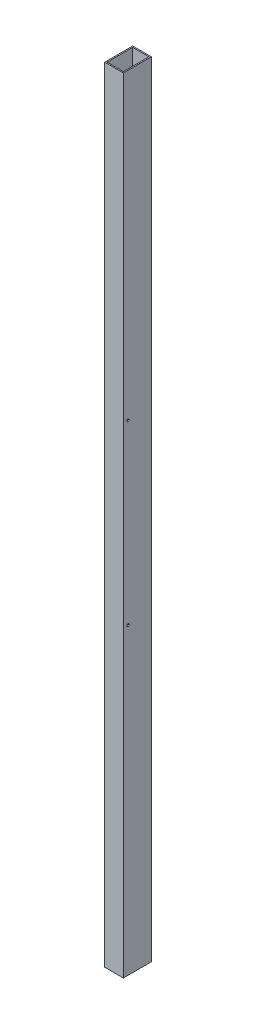
ISO-10303-21;
HEADER;
FILE_DESCRIPTION(('STEP AP214'),'2;1');
FILE_NAME('part.step','',(''),(''),'','','');
FILE_SCHEMA(('AUTOMOTIVE_DESIGN { 1 0 10303 214 1 1 1 1 }'));
ENDSEC;
DATA;
#1=APPLICATION_CONTEXT('core data for automotive mechanical design processes');
#2=APPLICATION_PROTOCOL_DEFINITION('international standard','automotive_design',2000,#1);
#3=PRODUCT_CONTEXT('',#1,'mechanical');
#4=PRODUCT('Part','Part','',(#3));
#5=PRODUCT_RELATED_PRODUCT_CATEGORY('part','',(#4));
#6=PRODUCT_DEFINITION_FORMATION('','',#4);
#7=PRODUCT_DEFINITION_CONTEXT('part definition',#1,'design');
#8=PRODUCT_DEFINITION('design','',#6,#7);
#9=PRODUCT_DEFINITION_SHAPE('','',#8);
#10=(LENGTH_UNIT() NAMED_UNIT(*) SI_UNIT(.MILLI.,.METRE.));
#11=(NAMED_UNIT(*) PLANE_ANGLE_UNIT() SI_UNIT($,.RADIAN.));
#12=(NAMED_UNIT(*) SI_UNIT($,.STERADIAN.) SOLID_ANGLE_UNIT());
#13=UNCERTAINTY_MEASURE_WITH_UNIT(LENGTH_MEASURE(1.E-05),#10,'distance_accuracy_value','');
#14=(GEOMETRIC_REPRESENTATION_CONTEXT(3) GLOBAL_UNCERTAINTY_ASSIGNED_CONTEXT((#13)) GLOBAL_UNIT_ASSIGNED_CONTEXT((#10,
#11,#12)) REPRESENTATION_CONTEXT('',''));
#15=CARTESIAN_POINT('',(0.,0.,0.));
#16=DIRECTION('',(0.,0.,1.));
#17=DIRECTION('',(1.,0.,0.));
#18=AXIS2_PLACEMENT_3D('',#15,#16,#17);
#19=CARTESIAN_POINT('',(0.,-1066.8,0.));
#20=DIRECTION('',(0.,-1.,0.));
#21=DIRECTION('',(1.,0.,0.));
#22=AXIS2_PLACEMENT_3D('',#19,#20,#21);
#23=PLANE('',#22);
#24=DIRECTION('',(0.,0.,-1.));
#25=VECTOR('',#24,1.);
#26=CARTESIAN_POINT('',(25.4,-1066.8,0.));
#27=LINE('',#26,#25);
#28=CARTESIAN_POINT('',(25.4,-1066.8,38.1));
#29=VERTEX_POINT('',#28);
#30=CARTESIAN_POINT('',(25.4,-1066.8,-38.1));
#31=VERTEX_POINT('',#30);
#32=EDGE_CURVE('E151',#29,#31,#27,.T.);
#33=ORIENTED_EDGE('',*,*,#32,.F.);
#34=DIRECTION('',(-1.,0.,0.));
#35=VECTOR('',#34,1.);
#36=CARTESIAN_POINT('',(0.,-1066.8,38.1));
#37=LINE('',#36,#35);
#38=CARTESIAN_POINT('',(-25.4,-1066.8,38.1));
#39=VERTEX_POINT('',#38);
#40=EDGE_CURVE('E155',#29,#39,#37,.T.);
#41=ORIENTED_EDGE('',*,*,#40,.T.);
#42=DIRECTION('',(0.,0.,-1.));
#43=VECTOR('',#42,1.);
#44=CARTESIAN_POINT('',(-25.4,-1066.8,0.));
#45=LINE('',#44,#43);
#46=CARTESIAN_POINT('',(-25.4,-1066.8,-38.1));
#47=VERTEX_POINT('',#46);
#48=EDGE_CURVE('E159',#39,#47,#45,.T.);
#49=ORIENTED_EDGE('',*,*,#48,.T.);
#50=DIRECTION('',(-1.,0.,0.));
#51=VECTOR('',#50,1.);
#52=CARTESIAN_POINT('',(0.,-1066.8,-38.1));
#53=LINE('',#52,#51);
#54=EDGE_CURVE('E162',#31,#47,#53,.T.);
#55=ORIENTED_EDGE('',*,*,#54,.F.);
#56=EDGE_LOOP('',(#33,#41,#49,#55));
#57=FACE_BOUND('',#56,.T.);
#58=DIRECTION('',(-1.,0.,0.));
#59=VECTOR('',#58,1.);
#60=CARTESIAN_POINT('',(0.,-1066.8,34.925));
#61=LINE('',#60,#59);
#62=CARTESIAN_POINT('',(22.225,-1066.8,34.925));
#63=VERTEX_POINT('',#62);
#64=CARTESIAN_POINT('',(-22.225,-1066.8,34.925));
#65=VERTEX_POINT('',#64);
#66=EDGE_CURVE('E136',#63,#65,#61,.T.);
#67=ORIENTED_EDGE('',*,*,#66,.F.);
#68=DIRECTION('',(0.,0.,-1.));
#69=VECTOR('',#68,1.);
#70=CARTESIAN_POINT('',(22.225,-1066.8,0.));
#71=LINE('',#70,#69);
#72=CARTESIAN_POINT('',(22.225,-1066.8,-34.925));
#73=VERTEX_POINT('',#72);
#74=EDGE_CURVE('E130',#63,#73,#71,.T.);
#75=ORIENTED_EDGE('',*,*,#74,.T.);
#76=DIRECTION('',(-1.,0.,0.));
#77=VECTOR('',#76,1.);
#78=CARTESIAN_POINT('',(0.,-1066.8,-34.925));
#79=LINE('',#78,#77);
#80=CARTESIAN_POINT('',(-22.225,-1066.8,-34.925));
#81=VERTEX_POINT('',#80);
#82=EDGE_CURVE('E111',#73,#81,#79,.T.);
#83=ORIENTED_EDGE('',*,*,#82,.T.);
#84=DIRECTION('',(0.,0.,-1.));
#85=VECTOR('',#84,1.);
#86=CARTESIAN_POINT('',(-22.225,-1066.8,0.));
#87=LINE('',#86,#85);
#88=EDGE_CURVE('E146',#65,#81,#87,.T.);
#89=ORIENTED_EDGE('',*,*,#88,.F.);
#90=EDGE_LOOP('',(#67,#75,#83,#89));
#91=FACE_BOUND('',#90,.T.);
#92=ADVANCED_FACE('F16',(#57,#91),#23,.T.);
#93=CARTESIAN_POINT('',(0.,1066.8,0.));
#94=DIRECTION('',(0.,-1.,0.));
#95=DIRECTION('',(1.,0.,0.));
#96=AXIS2_PLACEMENT_3D('',#93,#94,#95);
#97=PLANE('',#96);
#98=DIRECTION('',(0.,0.,-1.));
#99=VECTOR('',#98,1.);
#100=CARTESIAN_POINT('',(25.4,1066.8,0.));
#101=LINE('',#100,#99);
#102=CARTESIAN_POINT('',(25.4,1066.8,38.1));
#103=VERTEX_POINT('',#102);
#104=CARTESIAN_POINT('',(25.4,1066.8,-38.1));
#105=VERTEX_POINT('',#104);
#106=EDGE_CURVE('E167',#103,#105,#101,.T.);
#107=ORIENTED_EDGE('',*,*,#106,.T.);
#108=DIRECTION('',(-1.,0.,0.));
#109=VECTOR('',#108,1.);
#110=CARTESIAN_POINT('',(0.,1066.8,-38.1));
#111=LINE('',#110,#109);
#112=CARTESIAN_POINT('',(-25.4,1066.8,-38.1));
#113=VERTEX_POINT('',#112);
#114=EDGE_CURVE('E156',#105,#113,#111,.T.);
#115=ORIENTED_EDGE('',*,*,#114,.T.);
#116=DIRECTION('',(0.,0.,-1.));
#117=VECTOR('',#116,1.);
#118=CARTESIAN_POINT('',(-25.4,1066.8,0.));
#119=LINE('',#118,#117);
#120=CARTESIAN_POINT('',(-25.4,1066.8,38.1));
#121=VERTEX_POINT('',#120);
#122=EDGE_CURVE('E173',#121,#113,#119,.T.);
#123=ORIENTED_EDGE('',*,*,#122,.F.);
#124=DIRECTION('',(-1.,0.,0.));
#125=VECTOR('',#124,1.);
#126=CARTESIAN_POINT('',(0.,1066.8,38.1));
#127=LINE('',#126,#125);
#128=EDGE_CURVE('E170',#103,#121,#127,.T.);
#129=ORIENTED_EDGE('',*,*,#128,.F.);
#130=EDGE_LOOP('',(#107,#115,#123,#129));
#131=FACE_BOUND('',#130,.T.);
#132=DIRECTION('',(0.,0.,-1.));
#133=VECTOR('',#132,1.);
#134=CARTESIAN_POINT('',(22.225,1066.8,0.));
#135=LINE('',#134,#133);
#136=CARTESIAN_POINT('',(22.225,1066.8,34.925));
#137=VERTEX_POINT('',#136);
#138=CARTESIAN_POINT('',(22.225,1066.8,-34.925));
#139=VERTEX_POINT('',#138);
#140=EDGE_CURVE('E118',#137,#139,#135,.T.);
#141=ORIENTED_EDGE('',*,*,#140,.F.);
#142=DIRECTION('',(-1.,0.,0.));
#143=VECTOR('',#142,1.);
#144=CARTESIAN_POINT('',(0.,1066.8,34.925));
#145=LINE('',#144,#143);
#146=CARTESIAN_POINT('',(-22.225,1066.8,34.925));
#147=VERTEX_POINT('',#146);
#148=EDGE_CURVE('E125',#137,#147,#145,.T.);
#149=ORIENTED_EDGE('',*,*,#148,.T.);
#150=DIRECTION('',(0.,0.,-1.));
#151=VECTOR('',#150,1.);
#152=CARTESIAN_POINT('',(-22.225,1066.8,0.));
#153=LINE('',#152,#151);
#154=CARTESIAN_POINT('',(-22.225,1066.8,-34.925));
#155=VERTEX_POINT('',#154);
#156=EDGE_CURVE('E51',#147,#155,#153,.T.);
#157=ORIENTED_EDGE('',*,*,#156,.T.);
#158=DIRECTION('',(-1.,0.,0.));
#159=VECTOR('',#158,1.);
#160=CARTESIAN_POINT('',(0.,1066.8,-34.925));
#161=LINE('',#160,#159);
#162=EDGE_CURVE('E109',#139,#155,#161,.T.);
#163=ORIENTED_EDGE('',*,*,#162,.F.);
#164=EDGE_LOOP('',(#141,#149,#157,#163));
#165=FACE_BOUND('',#164,.T.);
#166=ADVANCED_FACE('F128',(#131,#165),#97,.F.);
#167=CARTESIAN_POINT('',(25.4,-1066.8,0.));
#168=DIRECTION('',(1.,0.,0.));
#169=DIRECTION('',(0.,0.,-1.));
#170=AXIS2_PLACEMENT_3D('',#167,#168,#169);
#171=PLANE('',#170);
#172=CARTESIAN_POINT('',(25.4,241.3,25.4));
#173=DIRECTION('',(1.,0.,0.));
#174=DIRECTION('',(0.,0.,-1.));
#175=AXIS2_PLACEMENT_3D('',#172,#173,#174);
#176=CIRCLE('',#175,3.3655);
#177=CARTESIAN_POINT('',(25.4,241.3,22.0345));
#178=VERTEX_POINT('',#177);
#179=EDGE_CURVE('E283',#178,#178,#176,.T.);
#180=ORIENTED_EDGE('',*,*,#179,.F.);
#181=EDGE_LOOP('',(#180));
#182=FACE_BOUND('',#181,.T.);
#183=CARTESIAN_POINT('',(25.4,-241.3,25.4));
#184=DIRECTION('',(1.,0.,0.));
#185=DIRECTION('',(0.,0.,-1.));
#186=AXIS2_PLACEMENT_3D('',#183,#184,#185);
#187=CIRCLE('',#186,3.3655);
#188=CARTESIAN_POINT('',(25.4,-241.3,22.0345));
#189=VERTEX_POINT('',#188);
#190=EDGE_CURVE('E191',#189,#189,#187,.T.);
#191=ORIENTED_EDGE('',*,*,#190,.F.);
#192=EDGE_LOOP('',(#191));
#193=FACE_BOUND('',#192,.T.);
#194=ORIENTED_EDGE('',*,*,#106,.F.);
#195=DIRECTION('',(0.,1.,0.));
#196=VECTOR('',#195,1.);
#197=CARTESIAN_POINT('',(25.4,-1066.8,38.1));
#198=LINE('',#197,#196);
#199=EDGE_CURVE('E11',#29,#103,#198,.T.);
#200=ORIENTED_EDGE('',*,*,#199,.F.);
#201=ORIENTED_EDGE('',*,*,#32,.T.);
#202=DIRECTION('',(0.,1.,0.));
#203=VECTOR('',#202,1.);
#204=CARTESIAN_POINT('',(25.4,-1066.8,-38.1));
#205=LINE('',#204,#203);
#206=EDGE_CURVE('E166',#31,#105,#205,.T.);
#207=ORIENTED_EDGE('',*,*,#206,.T.);
#208=EDGE_LOOP('',(#194,#200,#201,#207));
#209=FACE_BOUND('',#208,.T.);
#210=ADVANCED_FACE('F18',(#182,#193,#209),#171,.T.);
#211=CARTESIAN_POINT('',(0.,-1066.8,38.1));
#212=DIRECTION('',(0.,0.,-1.));
#213=DIRECTION('',(-1.,0.,0.));
#214=AXIS2_PLACEMENT_3D('',#211,#212,#213);
#215=PLANE('',#214);
#216=ORIENTED_EDGE('',*,*,#128,.T.);
#217=DIRECTION('',(0.,1.,0.));
#218=VECTOR('',#217,1.);
#219=CARTESIAN_POINT('',(-25.4,-1066.8,38.1));
#220=LINE('',#219,#218);
#221=EDGE_CURVE('E26',#39,#121,#220,.T.);
#222=ORIENTED_EDGE('',*,*,#221,.F.);
#223=ORIENTED_EDGE('',*,*,#40,.F.);
#224=ORIENTED_EDGE('',*,*,#199,.T.);
#225=EDGE_LOOP('',(#216,#222,#223,#224));
#226=FACE_BOUND('',#225,.T.);
#227=ADVANCED_FACE('F258',(#226),#215,.F.);
#228=CARTESIAN_POINT('',(-25.4,-1066.8,0.));
#229=DIRECTION('',(1.,0.,0.));
#230=DIRECTION('',(0.,0.,-1.));
#231=AXIS2_PLACEMENT_3D('',#228,#229,#230);
#232=PLANE('',#231);
#233=CARTESIAN_POINT('',(-25.4,241.3,25.4));
#234=DIRECTION('',(1.,0.,0.));
#235=DIRECTION('',(0.,0.,-1.));
#236=AXIS2_PLACEMENT_3D('',#233,#234,#235);
#237=CIRCLE('',#236,3.3655);
#238=CARTESIAN_POINT('',(-25.4,241.3,22.0345));
#239=VERTEX_POINT('',#238);
#240=EDGE_CURVE('E201',#239,#239,#237,.F.);
#241=ORIENTED_EDGE('',*,*,#240,.F.);
#242=EDGE_LOOP('',(#241));
#243=FACE_BOUND('',#242,.T.);
#244=CARTESIAN_POINT('',(-25.4,-241.3,25.4));
#245=DIRECTION('',(1.,0.,0.));
#246=DIRECTION('',(0.,0.,-1.));
#247=AXIS2_PLACEMENT_3D('',#244,#245,#246);
#248=CIRCLE('',#247,3.3655);
#249=CARTESIAN_POINT('',(-25.4,-241.3,22.0345));
#250=VERTEX_POINT('',#249);
#251=EDGE_CURVE('E126',#250,#250,#248,.F.);
#252=ORIENTED_EDGE('',*,*,#251,.F.);
#253=EDGE_LOOP('',(#252));
#254=FACE_BOUND('',#253,.T.);
#255=ORIENTED_EDGE('',*,*,#122,.T.);
#256=DIRECTION('',(0.,1.,0.));
#257=VECTOR('',#256,1.);
#258=CARTESIAN_POINT('',(-25.4,-1066.8,-38.1));
#259=LINE('',#258,#257);
#260=EDGE_CURVE('E182',#47,#113,#259,.T.);
#261=ORIENTED_EDGE('',*,*,#260,.F.);
#262=ORIENTED_EDGE('',*,*,#48,.F.);
#263=ORIENTED_EDGE('',*,*,#221,.T.);
#264=EDGE_LOOP('',(#255,#261,#262,#263));
#265=FACE_BOUND('',#264,.T.);
#266=ADVANCED_FACE('F255',(#243,#254,#265),#232,.F.);
#267=CARTESIAN_POINT('',(0.,-1066.8,-38.1));
#268=DIRECTION('',(0.,0.,-1.));
#269=DIRECTION('',(-1.,0.,0.));
#270=AXIS2_PLACEMENT_3D('',#267,#268,#269);
#271=PLANE('',#270);
#272=ORIENTED_EDGE('',*,*,#114,.F.);
#273=ORIENTED_EDGE('',*,*,#206,.F.);
#274=ORIENTED_EDGE('',*,*,#54,.T.);
#275=ORIENTED_EDGE('',*,*,#260,.T.);
#276=EDGE_LOOP('',(#272,#273,#274,#275));
#277=FACE_BOUND('',#276,.T.);
#278=ADVANCED_FACE('F239',(#277),#271,.T.);
#279=CARTESIAN_POINT('',(22.225,-1066.8,0.));
#280=DIRECTION('',(1.,0.,0.));
#281=DIRECTION('',(0.,0.,-1.));
#282=AXIS2_PLACEMENT_3D('',#279,#280,#281);
#283=PLANE('',#282);
#284=CARTESIAN_POINT('',(22.225,241.3,25.4));
#285=DIRECTION('',(1.,0.,0.));
#286=DIRECTION('',(0.,0.,-1.));
#287=AXIS2_PLACEMENT_3D('',#284,#285,#286);
#288=CIRCLE('',#287,3.3655);
#289=CARTESIAN_POINT('',(22.225,241.3,22.0345));
#290=VERTEX_POINT('',#289);
#291=EDGE_CURVE('E210',#290,#290,#288,.F.);
#292=ORIENTED_EDGE('',*,*,#291,.F.);
#293=EDGE_LOOP('',(#292));
#294=FACE_BOUND('',#293,.T.);
#295=CARTESIAN_POINT('',(22.225,-241.3,25.4));
#296=DIRECTION('',(1.,0.,0.));
#297=DIRECTION('',(0.,0.,-1.));
#298=AXIS2_PLACEMENT_3D('',#295,#296,#297);
#299=CIRCLE('',#298,3.3655);
#300=CARTESIAN_POINT('',(22.225,-241.3,22.0345));
#301=VERTEX_POINT('',#300);
#302=EDGE_CURVE('E190',#301,#301,#299,.F.);
#303=ORIENTED_EDGE('',*,*,#302,.F.);
#304=EDGE_LOOP('',(#303));
#305=FACE_BOUND('',#304,.T.);
#306=ORIENTED_EDGE('',*,*,#140,.T.);
#307=DIRECTION('',(0.,1.,0.));
#308=VECTOR('',#307,1.);
#309=CARTESIAN_POINT('',(22.225,-1066.8,-34.925));
#310=LINE('',#309,#308);
#311=EDGE_CURVE('E105',#73,#139,#310,.T.);
#312=ORIENTED_EDGE('',*,*,#311,.F.);
#313=ORIENTED_EDGE('',*,*,#74,.F.);
#314=DIRECTION('',(0.,1.,0.));
#315=VECTOR('',#314,1.);
#316=CARTESIAN_POINT('',(22.225,-1066.8,34.925));
#317=LINE('',#316,#315);
#318=EDGE_CURVE('E120',#63,#137,#317,.T.);
#319=ORIENTED_EDGE('',*,*,#318,.T.);
#320=EDGE_LOOP('',(#306,#312,#313,#319));
#321=FACE_BOUND('',#320,.T.);
#322=ADVANCED_FACE('F119',(#294,#305,#321),#283,.F.);
#323=CARTESIAN_POINT('',(0.,-1066.8,34.925));
#324=DIRECTION('',(0.,0.,-1.));
#325=DIRECTION('',(-1.,0.,0.));
#326=AXIS2_PLACEMENT_3D('',#323,#324,#325);
#327=PLANE('',#326);
#328=ORIENTED_EDGE('',*,*,#148,.F.);
#329=ORIENTED_EDGE('',*,*,#318,.F.);
#330=ORIENTED_EDGE('',*,*,#66,.T.);
#331=DIRECTION('',(0.,1.,0.));
#332=VECTOR('',#331,1.);
#333=CARTESIAN_POINT('',(-22.225,-1066.8,34.925));
#334=LINE('',#333,#332);
#335=EDGE_CURVE('E217',#65,#147,#334,.T.);
#336=ORIENTED_EDGE('',*,*,#335,.T.);
#337=EDGE_LOOP('',(#328,#329,#330,#336));
#338=FACE_BOUND('',#337,.T.);
#339=ADVANCED_FACE('F227',(#338),#327,.T.);
#340=CARTESIAN_POINT('',(-22.225,-1066.8,0.));
#341=DIRECTION('',(1.,0.,0.));
#342=DIRECTION('',(0.,0.,-1.));
#343=AXIS2_PLACEMENT_3D('',#340,#341,#342);
#344=PLANE('',#343);
#345=CARTESIAN_POINT('',(-22.225,241.3,25.4));
#346=DIRECTION('',(1.,0.,0.));
#347=DIRECTION('',(0.,0.,-1.));
#348=AXIS2_PLACEMENT_3D('',#345,#346,#347);
#349=CIRCLE('',#348,3.3655);
#350=CARTESIAN_POINT('',(-22.225,241.3,22.0345));
#351=VERTEX_POINT('',#350);
#352=EDGE_CURVE('E20',#351,#351,#349,.F.);
#353=ORIENTED_EDGE('',*,*,#352,.T.);
#354=EDGE_LOOP('',(#353));
#355=FACE_BOUND('',#354,.T.);
#356=CARTESIAN_POINT('',(-22.225,-241.3,25.4));
#357=DIRECTION('',(1.,0.,0.));
#358=DIRECTION('',(0.,0.,-1.));
#359=AXIS2_PLACEMENT_3D('',#356,#357,#358);
#360=CIRCLE('',#359,3.3655);
#361=CARTESIAN_POINT('',(-22.225,-241.3,22.0345));
#362=VERTEX_POINT('',#361);
#363=EDGE_CURVE('E187',#362,#362,#360,.F.);
#364=ORIENTED_EDGE('',*,*,#363,.T.);
#365=EDGE_LOOP('',(#364));
#366=FACE_BOUND('',#365,.T.);
#367=ORIENTED_EDGE('',*,*,#156,.F.);
#368=ORIENTED_EDGE('',*,*,#335,.F.);
#369=ORIENTED_EDGE('',*,*,#88,.T.);
#370=DIRECTION('',(0.,1.,0.));
#371=VECTOR('',#370,1.);
#372=CARTESIAN_POINT('',(-22.225,-1066.8,-34.925));
#373=LINE('',#372,#371);
#374=EDGE_CURVE('E39',#81,#155,#373,.T.);
#375=ORIENTED_EDGE('',*,*,#374,.T.);
#376=EDGE_LOOP('',(#367,#368,#369,#375));
#377=FACE_BOUND('',#376,.T.);
#378=ADVANCED_FACE('F222',(#355,#366,#377),#344,.T.);
#379=CARTESIAN_POINT('',(0.,-1066.8,-34.925));
#380=DIRECTION('',(0.,0.,-1.));
#381=DIRECTION('',(-1.,0.,0.));
#382=AXIS2_PLACEMENT_3D('',#379,#380,#381);
#383=PLANE('',#382);
#384=ORIENTED_EDGE('',*,*,#162,.T.);
#385=ORIENTED_EDGE('',*,*,#374,.F.);
#386=ORIENTED_EDGE('',*,*,#82,.F.);
#387=ORIENTED_EDGE('',*,*,#311,.T.);
#388=EDGE_LOOP('',(#384,#385,#386,#387));
#389=FACE_BOUND('',#388,.T.);
#390=ADVANCED_FACE('F107',(#389),#383,.F.);
#391=CARTESIAN_POINT('',(-2111.17566993004,-241.3,25.4));
#392=DIRECTION('',(1.,0.,0.));
#393=DIRECTION('',(0.,0.,-1.));
#394=AXIS2_PLACEMENT_3D('',#391,#392,#393);
#395=CYLINDRICAL_SURFACE('',#394,3.3655);
#396=ORIENTED_EDGE('',*,*,#363,.F.);
#397=EDGE_LOOP('',(#396));
#398=FACE_BOUND('',#397,.T.);
#399=ORIENTED_EDGE('',*,*,#251,.T.);
#400=EDGE_LOOP('',(#399));
#401=FACE_BOUND('',#400,.T.);
#402=ADVANCED_FACE('F302',(#398,#401),#395,.F.);
#403=ORIENTED_EDGE('',*,*,#190,.T.);
#404=EDGE_LOOP('',(#403));
#405=FACE_BOUND('',#404,.T.);
#406=ORIENTED_EDGE('',*,*,#302,.T.);
#407=EDGE_LOOP('',(#406));
#408=FACE_BOUND('',#407,.T.);
#409=ADVANCED_FACE('F299',(#405,#408),#395,.F.);
#410=CARTESIAN_POINT('',(-2111.17566993004,241.3,25.4));
#411=DIRECTION('',(1.,0.,0.));
#412=DIRECTION('',(0.,0.,-1.));
#413=AXIS2_PLACEMENT_3D('',#410,#411,#412);
#414=CYLINDRICAL_SURFACE('',#413,3.3655);
#415=ORIENTED_EDGE('',*,*,#352,.F.);
#416=EDGE_LOOP('',(#415));
#417=FACE_BOUND('',#416,.T.);
#418=ORIENTED_EDGE('',*,*,#240,.T.);
#419=EDGE_LOOP('',(#418));
#420=FACE_BOUND('',#419,.T.);
#421=ADVANCED_FACE('F301',(#417,#420),#414,.F.);
#422=ORIENTED_EDGE('',*,*,#179,.T.);
#423=EDGE_LOOP('',(#422));
#424=FACE_BOUND('',#423,.T.);
#425=ORIENTED_EDGE('',*,*,#291,.T.);
#426=EDGE_LOOP('',(#425));
#427=FACE_BOUND('',#426,.T.);
#428=ADVANCED_FACE('F295',(#424,#427),#414,.F.);
#429=CLOSED_SHELL('',(#92,#166,#210,#227,#266,#278,#322,#339,#378,#390,#402,#409,#421,#428));
#430=MANIFOLD_SOLID_BREP('B1',#429);
#431=ADVANCED_BREP_SHAPE_REPRESENTATION('',(#18,#430),#14);
#432=SHAPE_DEFINITION_REPRESENTATION(#9,#431);
ENDSEC;
END-ISO-10303-21;
